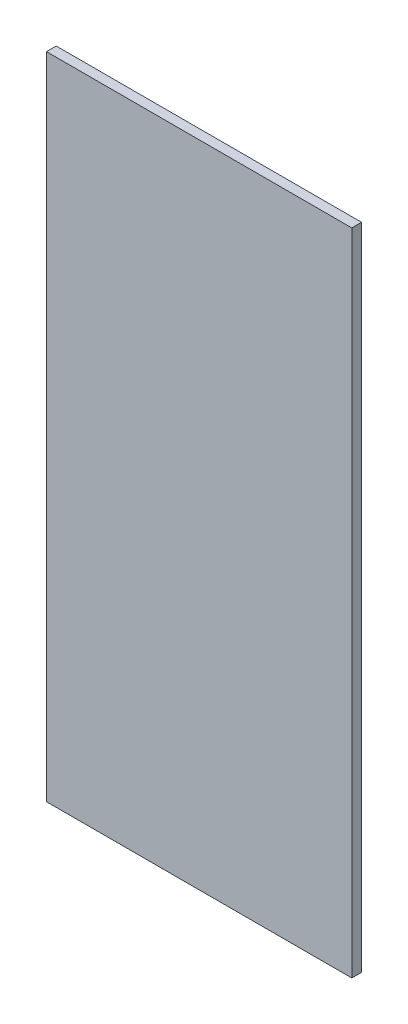
ISO-10303-21;
HEADER;
FILE_DESCRIPTION(('STEP AP214'),'2;1');
FILE_NAME('part.step','',(''),(''),'','','');
FILE_SCHEMA(('AUTOMOTIVE_DESIGN { 1 0 10303 214 1 1 1 1 }'));
ENDSEC;
DATA;
#1=APPLICATION_CONTEXT('core data for automotive mechanical design processes');
#2=APPLICATION_PROTOCOL_DEFINITION('international standard','automotive_design',2000,#1);
#3=PRODUCT_CONTEXT('',#1,'mechanical');
#4=PRODUCT('Part','Part','',(#3));
#5=PRODUCT_RELATED_PRODUCT_CATEGORY('part','',(#4));
#6=PRODUCT_DEFINITION_FORMATION('','',#4);
#7=PRODUCT_DEFINITION_CONTEXT('part definition',#1,'design');
#8=PRODUCT_DEFINITION('design','',#6,#7);
#9=PRODUCT_DEFINITION_SHAPE('','',#8);
#10=(LENGTH_UNIT() NAMED_UNIT(*) SI_UNIT(.MILLI.,.METRE.));
#11=(NAMED_UNIT(*) PLANE_ANGLE_UNIT() SI_UNIT($,.RADIAN.));
#12=(NAMED_UNIT(*) SI_UNIT($,.STERADIAN.) SOLID_ANGLE_UNIT());
#13=UNCERTAINTY_MEASURE_WITH_UNIT(LENGTH_MEASURE(1.E-05),#10,'distance_accuracy_value','');
#14=(GEOMETRIC_REPRESENTATION_CONTEXT(3) GLOBAL_UNCERTAINTY_ASSIGNED_CONTEXT((#13)) GLOBAL_UNIT_ASSIGNED_CONTEXT((#10,
#11,#12)) REPRESENTATION_CONTEXT('',''));
#15=CARTESIAN_POINT('',(0.,0.,0.));
#16=DIRECTION('',(0.,0.,1.));
#17=DIRECTION('',(1.,0.,0.));
#18=AXIS2_PLACEMENT_3D('',#15,#16,#17);
#19=CARTESIAN_POINT('',(53.,0.,0.));
#20=DIRECTION('',(0.,-1.,0.));
#21=DIRECTION('',(0.,0.,-1.));
#22=AXIS2_PLACEMENT_3D('',#19,#20,#21);
#23=PLANE('',#22);
#24=DIRECTION('',(1.,0.,0.));
#25=VECTOR('',#24,1.);
#26=CARTESIAN_POINT('',(3.,0.,0.));
#27=LINE('',#26,#25);
#28=CARTESIAN_POINT('',(3.,0.,0.));
#29=VERTEX_POINT('',#28);
#30=CARTESIAN_POINT('',(97.,0.,0.));
#31=VERTEX_POINT('',#30);
#32=EDGE_CURVE('E11',#29,#31,#27,.T.);
#33=ORIENTED_EDGE('',*,*,#32,.T.);
#34=DIRECTION('',(0.,0.,1.));
#35=VECTOR('',#34,1.);
#36=CARTESIAN_POINT('',(97.,0.,0.));
#37=LINE('',#36,#35);
#38=CARTESIAN_POINT('',(97.,0.,3.));
#39=VERTEX_POINT('',#38);
#40=EDGE_CURVE('E63',#31,#39,#37,.T.);
#41=ORIENTED_EDGE('',*,*,#40,.T.);
#42=DIRECTION('',(-1.,0.,0.));
#43=VECTOR('',#42,1.);
#44=CARTESIAN_POINT('',(97.,0.,3.));
#45=LINE('',#44,#43);
#46=CARTESIAN_POINT('',(3.,0.,3.));
#47=VERTEX_POINT('',#46);
#48=EDGE_CURVE('E66',#39,#47,#45,.T.);
#49=ORIENTED_EDGE('',*,*,#48,.T.);
#50=DIRECTION('',(0.,0.,-1.));
#51=VECTOR('',#50,1.);
#52=CARTESIAN_POINT('',(3.,0.,3.));
#53=LINE('',#52,#51);
#54=EDGE_CURVE('E167',#47,#29,#53,.T.);
#55=ORIENTED_EDGE('',*,*,#54,.T.);
#56=EDGE_LOOP('',(#33,#41,#49,#55));
#57=FACE_BOUND('',#56,.T.);
#58=ADVANCED_FACE('F17',(#57),#23,.T.);
#59=CARTESIAN_POINT('',(53.,200.,0.));
#60=DIRECTION('',(0.,1.,0.));
#61=DIRECTION('',(1.,0.,0.));
#62=AXIS2_PLACEMENT_3D('',#59,#60,#61);
#63=PLANE('',#62);
#64=DIRECTION('',(1.,0.,0.));
#65=VECTOR('',#64,1.);
#66=CARTESIAN_POINT('',(3.,200.,0.));
#67=LINE('',#66,#65);
#68=CARTESIAN_POINT('',(3.,200.,0.));
#69=VERTEX_POINT('',#68);
#70=CARTESIAN_POINT('',(97.,200.,0.));
#71=VERTEX_POINT('',#70);
#72=EDGE_CURVE('E28',#69,#71,#67,.T.);
#73=ORIENTED_EDGE('',*,*,#72,.F.);
#74=DIRECTION('',(0.,0.,-1.));
#75=VECTOR('',#74,1.);
#76=CARTESIAN_POINT('',(3.,200.,3.));
#77=LINE('',#76,#75);
#78=CARTESIAN_POINT('',(3.,200.,3.));
#79=VERTEX_POINT('',#78);
#80=EDGE_CURVE('E166',#79,#69,#77,.T.);
#81=ORIENTED_EDGE('',*,*,#80,.F.);
#82=DIRECTION('',(-1.,0.,0.));
#83=VECTOR('',#82,1.);
#84=CARTESIAN_POINT('',(97.,200.,3.));
#85=LINE('',#84,#83);
#86=CARTESIAN_POINT('',(97.,200.,3.));
#87=VERTEX_POINT('',#86);
#88=EDGE_CURVE('E85',#87,#79,#85,.T.);
#89=ORIENTED_EDGE('',*,*,#88,.F.);
#90=DIRECTION('',(0.,0.,1.));
#91=VECTOR('',#90,1.);
#92=CARTESIAN_POINT('',(97.,200.,0.));
#93=LINE('',#92,#91);
#94=EDGE_CURVE('E72',#71,#87,#93,.T.);
#95=ORIENTED_EDGE('',*,*,#94,.F.);
#96=EDGE_LOOP('',(#73,#81,#89,#95));
#97=FACE_BOUND('',#96,.T.);
#98=ADVANCED_FACE('F107',(#97),#63,.T.);
#99=CARTESIAN_POINT('',(3.,200.,0.));
#100=DIRECTION('',(0.,0.,-1.));
#101=DIRECTION('',(-1.,0.,0.));
#102=AXIS2_PLACEMENT_3D('',#99,#100,#101);
#103=PLANE('',#102);
#104=ORIENTED_EDGE('',*,*,#72,.T.);
#105=DIRECTION('',(0.,-1.,0.));
#106=VECTOR('',#105,1.);
#107=CARTESIAN_POINT('',(97.,200.,0.));
#108=LINE('',#107,#106);
#109=EDGE_CURVE('E71',#71,#31,#108,.T.);
#110=ORIENTED_EDGE('',*,*,#109,.T.);
#111=ORIENTED_EDGE('',*,*,#32,.F.);
#112=DIRECTION('',(0.,-1.,0.));
#113=VECTOR('',#112,1.);
#114=CARTESIAN_POINT('',(3.,200.,0.));
#115=LINE('',#114,#113);
#116=EDGE_CURVE('E103',#69,#29,#115,.T.);
#117=ORIENTED_EDGE('',*,*,#116,.F.);
#118=EDGE_LOOP('',(#104,#110,#111,#117));
#119=FACE_BOUND('',#118,.T.);
#120=ADVANCED_FACE('F101',(#119),#103,.T.);
#121=CARTESIAN_POINT('',(97.,200.,0.));
#122=DIRECTION('',(1.,0.,0.));
#123=DIRECTION('',(0.,0.,-1.));
#124=AXIS2_PLACEMENT_3D('',#121,#122,#123);
#125=PLANE('',#124);
#126=ORIENTED_EDGE('',*,*,#94,.T.);
#127=DIRECTION('',(0.,-1.,0.));
#128=VECTOR('',#127,1.);
#129=CARTESIAN_POINT('',(97.,200.,3.));
#130=LINE('',#129,#128);
#131=EDGE_CURVE('E21',#87,#39,#130,.T.);
#132=ORIENTED_EDGE('',*,*,#131,.T.);
#133=ORIENTED_EDGE('',*,*,#40,.F.);
#134=ORIENTED_EDGE('',*,*,#109,.F.);
#135=EDGE_LOOP('',(#126,#132,#133,#134));
#136=FACE_BOUND('',#135,.T.);
#137=ADVANCED_FACE('F19',(#136),#125,.T.);
#138=CARTESIAN_POINT('',(97.,200.,3.));
#139=DIRECTION('',(0.,0.,1.));
#140=DIRECTION('',(1.,0.,0.));
#141=AXIS2_PLACEMENT_3D('',#138,#139,#140);
#142=PLANE('',#141);
#143=ORIENTED_EDGE('',*,*,#88,.T.);
#144=DIRECTION('',(0.,-1.,0.));
#145=VECTOR('',#144,1.);
#146=CARTESIAN_POINT('',(3.,200.,3.));
#147=LINE('',#146,#145);
#148=EDGE_CURVE('E82',#79,#47,#147,.T.);
#149=ORIENTED_EDGE('',*,*,#148,.T.);
#150=ORIENTED_EDGE('',*,*,#48,.F.);
#151=ORIENTED_EDGE('',*,*,#131,.F.);
#152=EDGE_LOOP('',(#143,#149,#150,#151));
#153=FACE_BOUND('',#152,.T.);
#154=ADVANCED_FACE('F80',(#153),#142,.T.);
#155=CARTESIAN_POINT('',(3.,200.,3.));
#156=DIRECTION('',(-1.,0.,0.));
#157=DIRECTION('',(0.,1.,0.));
#158=AXIS2_PLACEMENT_3D('',#155,#156,#157);
#159=PLANE('',#158);
#160=ORIENTED_EDGE('',*,*,#80,.T.);
#161=ORIENTED_EDGE('',*,*,#116,.T.);
#162=ORIENTED_EDGE('',*,*,#54,.F.);
#163=ORIENTED_EDGE('',*,*,#148,.F.);
#164=EDGE_LOOP('',(#160,#161,#162,#163));
#165=FACE_BOUND('',#164,.T.);
#166=ADVANCED_FACE('F144',(#165),#159,.T.);
#167=CLOSED_SHELL('',(#58,#98,#120,#137,#154,#166));
#168=MANIFOLD_SOLID_BREP('B1',#167);
#169=ADVANCED_BREP_SHAPE_REPRESENTATION('',(#18,#168),#14);
#170=SHAPE_DEFINITION_REPRESENTATION(#9,#169);
ENDSEC;
END-ISO-10303-21;
